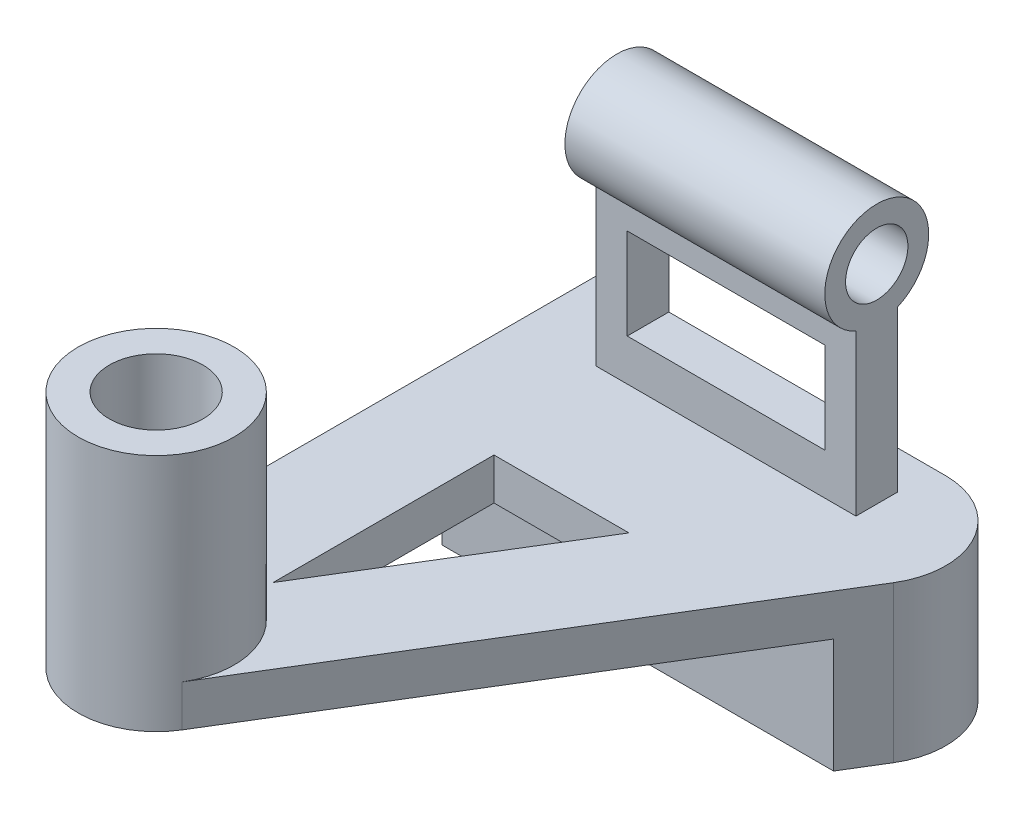
ISO-10303-21;
HEADER;
FILE_DESCRIPTION(('STEP AP214'),'2;1');
FILE_NAME('part.step','',(''),(''),'','','');
FILE_SCHEMA(('AUTOMOTIVE_DESIGN { 1 0 10303 214 1 1 1 1 }'));
ENDSEC;
DATA;
#1=APPLICATION_CONTEXT('core data for automotive mechanical design processes');
#2=APPLICATION_PROTOCOL_DEFINITION('international standard','automotive_design',2000,#1);
#3=PRODUCT_CONTEXT('',#1,'mechanical');
#4=PRODUCT('Part','Part','',(#3));
#5=PRODUCT_RELATED_PRODUCT_CATEGORY('part','',(#4));
#6=PRODUCT_DEFINITION_FORMATION('','',#4);
#7=PRODUCT_DEFINITION_CONTEXT('part definition',#1,'design');
#8=PRODUCT_DEFINITION('design','',#6,#7);
#9=PRODUCT_DEFINITION_SHAPE('','',#8);
#10=(LENGTH_UNIT() NAMED_UNIT(*) SI_UNIT(.MILLI.,.METRE.));
#11=(NAMED_UNIT(*) PLANE_ANGLE_UNIT() SI_UNIT($,.RADIAN.));
#12=(NAMED_UNIT(*) SI_UNIT($,.STERADIAN.) SOLID_ANGLE_UNIT());
#13=UNCERTAINTY_MEASURE_WITH_UNIT(LENGTH_MEASURE(1.E-05),#10,'distance_accuracy_value','');
#14=(GEOMETRIC_REPRESENTATION_CONTEXT(3) GLOBAL_UNCERTAINTY_ASSIGNED_CONTEXT((#13)) GLOBAL_UNIT_ASSIGNED_CONTEXT((#10,
#11,#12)) REPRESENTATION_CONTEXT('',''));
#15=CARTESIAN_POINT('',(0.,0.,0.));
#16=DIRECTION('',(0.,0.,1.));
#17=DIRECTION('',(1.,0.,0.));
#18=AXIS2_PLACEMENT_3D('',#15,#16,#17);
#19=CARTESIAN_POINT('',(66.9179016833369,8.,-30.3913043478261));
#20=DIRECTION('',(0.,-1.,0.));
#21=DIRECTION('',(0.,0.,-1.));
#22=AXIS2_PLACEMENT_3D('',#19,#20,#21);
#23=PLANE('',#22);
#24=DIRECTION('',(0.,0.,-1.));
#25=VECTOR('',#24,1.);
#26=CARTESIAN_POINT('',(65.,8.,-38.0259740090618));
#27=LINE('',#26,#25);
#28=CARTESIAN_POINT('',(65.,8.,-30.0259740090618));
#29=VERTEX_POINT('',#28);
#30=CARTESIAN_POINT('',(65.,8.,-38.0259740090618));
#31=VERTEX_POINT('',#30);
#32=EDGE_CURVE('E273',#29,#31,#27,.T.);
#33=ORIENTED_EDGE('',*,*,#32,.F.);
#34=DIRECTION('',(1.,0.,0.));
#35=VECTOR('',#34,1.);
#36=CARTESIAN_POINT('',(15.,8.,-30.0259740090618));
#37=LINE('',#36,#35);
#38=CARTESIAN_POINT('',(15.,8.,-30.0259740090618));
#39=VERTEX_POINT('',#38);
#40=EDGE_CURVE('E283',#39,#29,#37,.T.);
#41=ORIENTED_EDGE('',*,*,#40,.F.);
#42=DIRECTION('',(0.,0.,1.));
#43=VECTOR('',#42,1.);
#44=CARTESIAN_POINT('',(15.,8.,-38.0259740090618));
#45=LINE('',#44,#43);
#46=CARTESIAN_POINT('',(15.,8.,-38.0259740090618));
#47=VERTEX_POINT('',#46);
#48=EDGE_CURVE('E280',#47,#39,#45,.T.);
#49=ORIENTED_EDGE('',*,*,#48,.F.);
#50=DIRECTION('',(-1.,0.,0.));
#51=VECTOR('',#50,1.);
#52=CARTESIAN_POINT('',(15.,8.,-38.0259740090618));
#53=LINE('',#52,#51);
#54=EDGE_CURVE('E277',#31,#47,#53,.T.);
#55=ORIENTED_EDGE('',*,*,#54,.F.);
#56=EDGE_LOOP('',(#33,#41,#49,#55));
#57=FACE_BOUND('',#56,.T.);
#58=CARTESIAN_POINT('',(15.,8.,54.6086956521739));
#59=DIRECTION('',(0.,1.,0.));
#60=DIRECTION('',(0.,0.,1.));
#61=AXIS2_PLACEMENT_3D('',#58,#59,#60);
#62=CIRCLE('',#61,15.);
#63=CARTESIAN_POINT('',(27.8010057663305,8.,62.4275351677525));
#64=VERTEX_POINT('',#63);
#65=CARTESIAN_POINT('',(0.,8.,54.6086956521739));
#66=VERTEX_POINT('',#65);
#67=EDGE_CURVE('E220',#64,#66,#62,.T.);
#68=ORIENTED_EDGE('',*,*,#67,.F.);
#69=DIRECTION('',(0.521255967705237,0.,-0.853400384422035));
#70=VECTOR('',#69,1.);
#71=CARTESIAN_POINT('',(79.7189074496675,8.,-22.5724648322475));
#72=LINE('',#71,#70);
#73=CARTESIAN_POINT('',(79.7189074496675,8.,-22.5724648322475));
#74=VERTEX_POINT('',#73);
#75=EDGE_CURVE('E300',#64,#74,#72,.T.);
#76=ORIENTED_EDGE('',*,*,#75,.T.);
#77=CARTESIAN_POINT('',(66.9179016833369,8.,-30.3913043478261));
#78=DIRECTION('',(0.,1.,0.));
#79=DIRECTION('',(0.,0.,-1.));
#80=AXIS2_PLACEMENT_3D('',#77,#78,#79);
#81=CIRCLE('',#80,15.);
#82=CARTESIAN_POINT('',(66.9179016833369,8.,-45.3913043478261));
#83=VERTEX_POINT('',#82);
#84=EDGE_CURVE('E302',#74,#83,#81,.T.);
#85=ORIENTED_EDGE('',*,*,#84,.T.);
#86=DIRECTION('',(-1.,0.,0.));
#87=VECTOR('',#86,1.);
#88=CARTESIAN_POINT('',(0.,8.,-45.3913043478261));
#89=LINE('',#88,#87);
#90=CARTESIAN_POINT('',(0.,8.,-45.3913043478261));
#91=VERTEX_POINT('',#90);
#92=EDGE_CURVE('E295',#83,#91,#89,.T.);
#93=ORIENTED_EDGE('',*,*,#92,.T.);
#94=DIRECTION('',(0.,0.,1.));
#95=VECTOR('',#94,1.);
#96=CARTESIAN_POINT('',(0.,8.,54.6086956521739));
#97=LINE('',#96,#95);
#98=EDGE_CURVE('E298',#91,#66,#97,.T.);
#99=ORIENTED_EDGE('',*,*,#98,.T.);
#100=EDGE_LOOP('',(#68,#76,#85,#93,#99));
#101=FACE_BOUND('',#100,.T.);
#102=DIRECTION('',(1.,0.,0.));
#103=VECTOR('',#102,1.);
#104=CARTESIAN_POINT('',(20.,8.,-5.39130434782609));
#105=LINE('',#104,#103);
#106=CARTESIAN_POINT('',(20.,8.,-5.39130434782608));
#107=VERTEX_POINT('',#106);
#108=CARTESIAN_POINT('',(45.9589508416685,8.,-5.3913043478261));
#109=VERTEX_POINT('',#108);
#110=EDGE_CURVE('E64',#107,#109,#105,.T.);
#111=ORIENTED_EDGE('',*,*,#110,.T.);
#112=DIRECTION('',(-0.521255967705237,0.,0.853400384422035));
#113=VECTOR('',#112,1.);
#114=CARTESIAN_POINT('',(45.9589508416685,8.,-5.3913043478261));
#115=LINE('',#114,#113);
#116=CARTESIAN_POINT('',(20.,8.,37.1086956521739));
#117=VERTEX_POINT('',#116);
#118=EDGE_CURVE('E201',#109,#117,#115,.T.);
#119=ORIENTED_EDGE('',*,*,#118,.T.);
#120=DIRECTION('',(0.,0.,-1.));
#121=VECTOR('',#120,1.);
#122=CARTESIAN_POINT('',(20.,8.,37.1086956521739));
#123=LINE('',#122,#121);
#124=EDGE_CURVE('E204',#117,#107,#123,.T.);
#125=ORIENTED_EDGE('',*,*,#124,.T.);
#126=EDGE_LOOP('',(#111,#119,#125));
#127=FACE_BOUND('',#126,.T.);
#128=ADVANCED_FACE('F41',(#57,#101,#127),#23,.F.);
#129=CARTESIAN_POINT('',(66.9179016833369,0.,-30.3913043478261));
#130=DIRECTION('',(0.,-1.,0.));
#131=DIRECTION('',(0.,0.,-1.));
#132=AXIS2_PLACEMENT_3D('',#129,#130,#131);
#133=PLANE('',#132);
#134=DIRECTION('',(-1.,0.,0.));
#135=VECTOR('',#134,1.);
#136=CARTESIAN_POINT('',(75.3326629319915,0.,-15.3913043478261));
#137=LINE('',#136,#135);
#138=CARTESIAN_POINT('',(75.3326629319915,0.,-15.3913043478261));
#139=VERTEX_POINT('',#138);
#140=CARTESIAN_POINT('',(0.,0.,-15.3913043478261));
#141=VERTEX_POINT('',#140);
#142=EDGE_CURVE('E56',#139,#141,#137,.T.);
#143=ORIENTED_EDGE('',*,*,#142,.F.);
#144=DIRECTION('',(0.521255967705237,0.,-0.853400384422035));
#145=VECTOR('',#144,1.);
#146=CARTESIAN_POINT('',(79.7189074496675,0.,-22.5724648322475));
#147=LINE('',#146,#145);
#148=CARTESIAN_POINT('',(27.8010057663305,0.,62.4275351677525));
#149=VERTEX_POINT('',#148);
#150=EDGE_CURVE('E190',#149,#139,#147,.T.);
#151=ORIENTED_EDGE('',*,*,#150,.F.);
#152=CARTESIAN_POINT('',(15.,0.,54.6086956521739));
#153=DIRECTION('',(0.,1.,0.));
#154=DIRECTION('',(0.,0.,1.));
#155=AXIS2_PLACEMENT_3D('',#152,#153,#154);
#156=CIRCLE('',#155,15.);
#157=CARTESIAN_POINT('',(0.,0.,54.6086956521739));
#158=VERTEX_POINT('',#157);
#159=EDGE_CURVE('E306',#158,#149,#156,.T.);
#160=ORIENTED_EDGE('',*,*,#159,.F.);
#161=DIRECTION('',(0.,0.,1.));
#162=VECTOR('',#161,1.);
#163=CARTESIAN_POINT('',(0.,0.,54.6086956521739));
#164=LINE('',#163,#162);
#165=EDGE_CURVE('E294',#141,#158,#164,.T.);
#166=ORIENTED_EDGE('',*,*,#165,.F.);
#167=EDGE_LOOP('',(#143,#151,#160,#166));
#168=FACE_BOUND('',#167,.T.);
#169=CARTESIAN_POINT('',(15.,0.,54.6086956521739));
#170=DIRECTION('',(0.,-1.,0.));
#171=DIRECTION('',(0.,0.,-1.));
#172=AXIS2_PLACEMENT_3D('',#169,#170,#171);
#173=CIRCLE('',#172,9.);
#174=CARTESIAN_POINT('',(15.,0.,45.6086956521739));
#175=VERTEX_POINT('',#174);
#176=EDGE_CURVE('E216',#175,#175,#173,.F.);
#177=ORIENTED_EDGE('',*,*,#176,.T.);
#178=EDGE_LOOP('',(#177));
#179=FACE_BOUND('',#178,.T.);
#180=DIRECTION('',(-0.521255967705237,0.,0.853400384422035));
#181=VECTOR('',#180,1.);
#182=CARTESIAN_POINT('',(45.9589508416685,0.,-5.3913043478261));
#183=LINE('',#182,#181);
#184=CARTESIAN_POINT('',(45.9589508416685,0.,-5.3913043478261));
#185=VERTEX_POINT('',#184);
#186=CARTESIAN_POINT('',(20.,0.,37.1086956521739));
#187=VERTEX_POINT('',#186);
#188=EDGE_CURVE('E191',#185,#187,#183,.T.);
#189=ORIENTED_EDGE('',*,*,#188,.F.);
#190=DIRECTION('',(1.,0.,0.));
#191=VECTOR('',#190,1.);
#192=CARTESIAN_POINT('',(20.,0.,-5.39130434782609));
#193=LINE('',#192,#191);
#194=CARTESIAN_POINT('',(20.,0.,-5.39130434782608));
#195=VERTEX_POINT('',#194);
#196=EDGE_CURVE('E193',#195,#185,#193,.T.);
#197=ORIENTED_EDGE('',*,*,#196,.F.);
#198=DIRECTION('',(0.,0.,-1.));
#199=VECTOR('',#198,1.);
#200=CARTESIAN_POINT('',(20.,0.,37.1086956521739));
#201=LINE('',#200,#199);
#202=EDGE_CURVE('E213',#187,#195,#201,.T.);
#203=ORIENTED_EDGE('',*,*,#202,.F.);
#204=EDGE_LOOP('',(#189,#197,#203));
#205=FACE_BOUND('',#204,.T.);
#206=ADVANCED_FACE('F322',(#168,#179,#205),#133,.T.);
#207=CARTESIAN_POINT('',(65.,46.,-38.0259740090618));
#208=DIRECTION('',(-1.,0.,0.));
#209=DIRECTION('',(0.,0.,1.));
#210=AXIS2_PLACEMENT_3D('',#207,#208,#209);
#211=PLANE('',#210);
#212=CARTESIAN_POINT('',(65.,48.,-34.0259740090618));
#213=DIRECTION('',(1.,0.,0.));
#214=DIRECTION('',(0.,0.,-1.));
#215=AXIS2_PLACEMENT_3D('',#212,#213,#214);
#216=CIRCLE('',#215,6.);
#217=CARTESIAN_POINT('',(65.,48.,-40.0259740090618));
#218=VERTEX_POINT('',#217);
#219=EDGE_CURVE('E259',#218,#218,#216,.T.);
#220=ORIENTED_EDGE('',*,*,#219,.F.);
#221=EDGE_LOOP('',(#220));
#222=FACE_BOUND('',#221,.T.);
#223=CARTESIAN_POINT('',(65.,48.,-34.0259740090618));
#224=DIRECTION('',(1.,0.,0.));
#225=DIRECTION('',(0.,0.,-1.));
#226=AXIS2_PLACEMENT_3D('',#223,#224,#225);
#227=CIRCLE('',#226,10.);
#228=CARTESIAN_POINT('',(65.,38.8348486100883,-38.0259740090618));
#229=VERTEX_POINT('',#228);
#230=CARTESIAN_POINT('',(65.,38.8348486100883,-30.0259740090618));
#231=VERTEX_POINT('',#230);
#232=EDGE_CURVE('E263',#229,#231,#227,.T.);
#233=ORIENTED_EDGE('',*,*,#232,.T.);
#234=DIRECTION('',(0.,-1.,0.));
#235=VECTOR('',#234,1.);
#236=CARTESIAN_POINT('',(65.,46.,-30.0259740090618));
#237=LINE('',#236,#235);
#238=EDGE_CURVE('E286',#231,#29,#237,.T.);
#239=ORIENTED_EDGE('',*,*,#238,.T.);
#240=ORIENTED_EDGE('',*,*,#32,.T.);
#241=DIRECTION('',(0.,-1.,0.));
#242=VECTOR('',#241,1.);
#243=CARTESIAN_POINT('',(65.,46.,-38.0259740090618));
#244=LINE('',#243,#242);
#245=EDGE_CURVE('E292',#229,#31,#244,.T.);
#246=ORIENTED_EDGE('',*,*,#245,.F.);
#247=EDGE_LOOP('',(#233,#239,#240,#246));
#248=FACE_BOUND('',#247,.T.);
#249=ADVANCED_FACE('F345',(#222,#248),#211,.F.);
#250=CARTESIAN_POINT('',(15.,46.,-38.0259740090618));
#251=DIRECTION('',(1.,0.,0.));
#252=DIRECTION('',(0.,0.,-1.));
#253=AXIS2_PLACEMENT_3D('',#250,#251,#252);
#254=PLANE('',#253);
#255=CARTESIAN_POINT('',(15.,48.,-34.0259740090617));
#256=DIRECTION('',(1.,0.,0.));
#257=DIRECTION('',(0.,0.,-1.));
#258=AXIS2_PLACEMENT_3D('',#255,#256,#257);
#259=CIRCLE('',#258,6.);
#260=CARTESIAN_POINT('',(15.,48.,-40.0259740090617));
#261=VERTEX_POINT('',#260);
#262=EDGE_CURVE('E260',#261,#261,#259,.T.);
#263=ORIENTED_EDGE('',*,*,#262,.T.);
#264=EDGE_LOOP('',(#263));
#265=FACE_BOUND('',#264,.T.);
#266=DIRECTION('',(0.,-1.,0.));
#267=VECTOR('',#266,1.);
#268=CARTESIAN_POINT('',(15.,46.,-30.0259740090618));
#269=LINE('',#268,#267);
#270=CARTESIAN_POINT('',(15.,38.8348486100883,-30.0259740090618));
#271=VERTEX_POINT('',#270);
#272=EDGE_CURVE('E288',#271,#39,#269,.T.);
#273=ORIENTED_EDGE('',*,*,#272,.F.);
#274=CARTESIAN_POINT('',(15.,48.,-34.0259740090617));
#275=DIRECTION('',(1.,0.,0.));
#276=DIRECTION('',(0.,0.,-1.));
#277=AXIS2_PLACEMENT_3D('',#274,#275,#276);
#278=CIRCLE('',#277,10.);
#279=CARTESIAN_POINT('',(15.,38.8348486100883,-38.0259740090618));
#280=VERTEX_POINT('',#279);
#281=EDGE_CURVE('E266',#280,#271,#278,.T.);
#282=ORIENTED_EDGE('',*,*,#281,.F.);
#283=DIRECTION('',(0.,-1.,0.));
#284=VECTOR('',#283,1.);
#285=CARTESIAN_POINT('',(15.,46.,-38.0259740090618));
#286=LINE('',#285,#284);
#287=EDGE_CURVE('E290',#280,#47,#286,.T.);
#288=ORIENTED_EDGE('',*,*,#287,.T.);
#289=ORIENTED_EDGE('',*,*,#48,.T.);
#290=EDGE_LOOP('',(#273,#282,#288,#289));
#291=FACE_BOUND('',#290,.T.);
#292=ADVANCED_FACE('F340',(#265,#291),#254,.F.);
#293=CARTESIAN_POINT('',(0.,8.,-45.3913043478261));
#294=DIRECTION('',(0.,0.,1.));
#295=DIRECTION('',(1.,0.,0.));
#296=AXIS2_PLACEMENT_3D('',#293,#294,#295);
#297=PLANE('',#296);
#298=DIRECTION('',(0.,-1.,0.));
#299=VECTOR('',#298,1.);
#300=CARTESIAN_POINT('',(66.9179016833369,8.,-45.3913043478261));
#301=LINE('',#300,#299);
#302=CARTESIAN_POINT('',(66.9179016833369,-22.,-45.3913043478261));
#303=VERTEX_POINT('',#302);
#304=EDGE_CURVE('E304',#83,#303,#301,.T.);
#305=ORIENTED_EDGE('',*,*,#304,.T.);
#306=DIRECTION('',(1.,0.,0.));
#307=VECTOR('',#306,1.);
#308=CARTESIAN_POINT('',(0.,-22.,-45.3913043478261));
#309=LINE('',#308,#307);
#310=CARTESIAN_POINT('',(0.,-22.,-45.3913043478261));
#311=VERTEX_POINT('',#310);
#312=EDGE_CURVE('E327',#311,#303,#309,.T.);
#313=ORIENTED_EDGE('',*,*,#312,.F.);
#314=DIRECTION('',(0.,-1.,0.));
#315=VECTOR('',#314,1.);
#316=CARTESIAN_POINT('',(0.,8.,-45.3913043478261));
#317=LINE('',#316,#315);
#318=EDGE_CURVE('E11',#91,#311,#317,.T.);
#319=ORIENTED_EDGE('',*,*,#318,.F.);
#320=ORIENTED_EDGE('',*,*,#92,.F.);
#321=EDGE_LOOP('',(#305,#313,#319,#320));
#322=FACE_BOUND('',#321,.T.);
#323=ADVANCED_FACE('F43',(#322),#297,.F.);
#324=CARTESIAN_POINT('',(0.,8.,54.6086956521739));
#325=DIRECTION('',(1.,0.,0.));
#326=DIRECTION('',(0.,0.,-1.));
#327=AXIS2_PLACEMENT_3D('',#324,#325,#326);
#328=PLANE('',#327);
#329=ORIENTED_EDGE('',*,*,#318,.T.);
#330=DIRECTION('',(0.,0.,-1.));
#331=VECTOR('',#330,1.);
#332=CARTESIAN_POINT('',(0.,-22.,-15.3913043478261));
#333=LINE('',#332,#331);
#334=CARTESIAN_POINT('',(0.,-22.,-15.3913043478261));
#335=VERTEX_POINT('',#334);
#336=EDGE_CURVE('E176',#335,#311,#333,.T.);
#337=ORIENTED_EDGE('',*,*,#336,.F.);
#338=DIRECTION('',(0.,1.,0.));
#339=VECTOR('',#338,1.);
#340=CARTESIAN_POINT('',(0.,-22.,-15.3913043478261));
#341=LINE('',#340,#339);
#342=EDGE_CURVE('E172',#335,#141,#341,.T.);
#343=ORIENTED_EDGE('',*,*,#342,.T.);
#344=ORIENTED_EDGE('',*,*,#165,.T.);
#345=DIRECTION('',(0.,-1.,0.));
#346=VECTOR('',#345,1.);
#347=CARTESIAN_POINT('',(0.,8.,54.6086956521739));
#348=LINE('',#347,#346);
#349=EDGE_CURVE('E49',#66,#158,#348,.T.);
#350=ORIENTED_EDGE('',*,*,#349,.F.);
#351=ORIENTED_EDGE('',*,*,#98,.F.);
#352=EDGE_LOOP('',(#329,#337,#343,#344,#350,#351));
#353=FACE_BOUND('',#352,.T.);
#354=ADVANCED_FACE('F324',(#353),#328,.F.);
#355=CARTESIAN_POINT('',(15.,8.,54.6086956521739));
#356=DIRECTION('',(0.,-1.,0.));
#357=DIRECTION('',(0.,0.,-1.));
#358=AXIS2_PLACEMENT_3D('',#355,#356,#357);
#359=CYLINDRICAL_SURFACE('',#358,15.);
#360=ORIENTED_EDGE('',*,*,#159,.T.);
#361=DIRECTION('',(0.,-1.,0.));
#362=VECTOR('',#361,1.);
#363=CARTESIAN_POINT('',(27.8010057663305,8.,62.4275351677525));
#364=LINE('',#363,#362);
#365=EDGE_CURVE('E312',#64,#149,#364,.T.);
#366=ORIENTED_EDGE('',*,*,#365,.F.);
#367=ORIENTED_EDGE('',*,*,#67,.T.);
#368=ORIENTED_EDGE('',*,*,#349,.T.);
#369=EDGE_LOOP('',(#360,#366,#367,#368));
#370=FACE_BOUND('',#369,.T.);
#371=CARTESIAN_POINT('',(15.,46.,54.6086956521739));
#372=DIRECTION('',(0.,1.,0.));
#373=DIRECTION('',(0.,0.,1.));
#374=AXIS2_PLACEMENT_3D('',#371,#372,#373);
#375=CIRCLE('',#374,15.);
#376=CARTESIAN_POINT('',(15.,46.,69.6086956521739));
#377=VERTEX_POINT('',#376);
#378=EDGE_CURVE('E223',#377,#377,#375,.T.);
#379=ORIENTED_EDGE('',*,*,#378,.F.);
#380=EDGE_LOOP('',(#379));
#381=FACE_BOUND('',#380,.T.);
#382=ADVANCED_FACE('F317',(#370,#381),#359,.T.);
#383=CARTESIAN_POINT('',(79.7189074496675,8.,-22.5724648322475));
#384=DIRECTION('',(-0.853400384422035,0.,-0.521255967705237));
#385=DIRECTION('',(-0.521255967705237,0.,0.853400384422035));
#386=AXIS2_PLACEMENT_3D('',#383,#384,#385);
#387=PLANE('',#386);
#388=ORIENTED_EDGE('',*,*,#150,.T.);
#389=DIRECTION('',(0.,1.,0.));
#390=VECTOR('',#389,1.);
#391=CARTESIAN_POINT('',(75.3326629319915,-22.,-15.3913043478261));
#392=LINE('',#391,#390);
#393=CARTESIAN_POINT('',(75.3326629319915,-22.,-15.3913043478261));
#394=VERTEX_POINT('',#393);
#395=EDGE_CURVE('E170',#394,#139,#392,.T.);
#396=ORIENTED_EDGE('',*,*,#395,.F.);
#397=DIRECTION('',(-0.521255967705237,0.,0.853400384422035));
#398=VECTOR('',#397,1.);
#399=CARTESIAN_POINT('',(79.7189074496675,-22.,-22.5724648322475));
#400=LINE('',#399,#398);
#401=CARTESIAN_POINT('',(79.7189074496675,-22.,-22.5724648322475));
#402=VERTEX_POINT('',#401);
#403=EDGE_CURVE('E177',#402,#394,#400,.T.);
#404=ORIENTED_EDGE('',*,*,#403,.F.);
#405=DIRECTION('',(0.,-1.,0.));
#406=VECTOR('',#405,1.);
#407=CARTESIAN_POINT('',(79.7189074496675,8.,-22.5724648322475));
#408=LINE('',#407,#406);
#409=EDGE_CURVE('E310',#74,#402,#408,.T.);
#410=ORIENTED_EDGE('',*,*,#409,.F.);
#411=ORIENTED_EDGE('',*,*,#75,.F.);
#412=ORIENTED_EDGE('',*,*,#365,.T.);
#413=EDGE_LOOP('',(#388,#396,#404,#410,#411,#412));
#414=FACE_BOUND('',#413,.T.);
#415=ADVANCED_FACE('F188',(#414),#387,.F.);
#416=CARTESIAN_POINT('',(66.9179016833369,8.,-30.3913043478261));
#417=DIRECTION('',(0.,-1.,0.));
#418=DIRECTION('',(0.,0.,-1.));
#419=AXIS2_PLACEMENT_3D('',#416,#417,#418);
#420=CYLINDRICAL_SURFACE('',#419,15.);
#421=ORIENTED_EDGE('',*,*,#409,.T.);
#422=CARTESIAN_POINT('',(66.9179016833369,-22.,-30.3913043478261));
#423=DIRECTION('',(0.,-1.,0.));
#424=DIRECTION('',(0.,0.,-1.));
#425=AXIS2_PLACEMENT_3D('',#422,#423,#424);
#426=CIRCLE('',#425,15.);
#427=EDGE_CURVE('E184',#303,#402,#426,.T.);
#428=ORIENTED_EDGE('',*,*,#427,.F.);
#429=ORIENTED_EDGE('',*,*,#304,.F.);
#430=ORIENTED_EDGE('',*,*,#84,.F.);
#431=EDGE_LOOP('',(#421,#428,#429,#430));
#432=FACE_BOUND('',#431,.T.);
#433=ADVANCED_FACE('F334',(#432),#420,.T.);
#434=CARTESIAN_POINT('',(15.,46.,-38.0259740090618));
#435=DIRECTION('',(0.,0.,1.));
#436=DIRECTION('',(1.,0.,0.));
#437=AXIS2_PLACEMENT_3D('',#434,#435,#436);
#438=PLANE('',#437);
#439=DIRECTION('',(-1.,0.,0.));
#440=VECTOR('',#439,1.);
#441=CARTESIAN_POINT('',(21.,16.,-38.0259740090618));
#442=LINE('',#441,#440);
#443=CARTESIAN_POINT('',(59.0000000000001,16.,-38.0259740090618));
#444=VERTEX_POINT('',#443);
#445=CARTESIAN_POINT('',(21.,16.,-38.0259740090618));
#446=VERTEX_POINT('',#445);
#447=EDGE_CURVE('E230',#444,#446,#442,.T.);
#448=ORIENTED_EDGE('',*,*,#447,.F.);
#449=DIRECTION('',(0.,-1.,0.));
#450=VECTOR('',#449,1.);
#451=CARTESIAN_POINT('',(59.0000000000001,33.5077024158081,-38.0259740090618));
#452=LINE('',#451,#450);
#453=CARTESIAN_POINT('',(59.0000000000001,33.5077024158081,-38.0259740090618));
#454=VERTEX_POINT('',#453);
#455=EDGE_CURVE('E233',#454,#444,#452,.T.);
#456=ORIENTED_EDGE('',*,*,#455,.F.);
#457=DIRECTION('',(1.,0.,0.));
#458=VECTOR('',#457,1.);
#459=CARTESIAN_POINT('',(21.,33.5077024158081,-38.0259740090618));
#460=LINE('',#459,#458);
#461=CARTESIAN_POINT('',(21.,33.5077024158081,-38.0259740090618));
#462=VERTEX_POINT('',#461);
#463=EDGE_CURVE('E250',#462,#454,#460,.T.);
#464=ORIENTED_EDGE('',*,*,#463,.F.);
#465=DIRECTION('',(0.,1.,0.));
#466=VECTOR('',#465,1.);
#467=CARTESIAN_POINT('',(21.,33.5077024158081,-38.0259740090618));
#468=LINE('',#467,#466);
#469=EDGE_CURVE('E226',#446,#462,#468,.T.);
#470=ORIENTED_EDGE('',*,*,#469,.F.);
#471=EDGE_LOOP('',(#448,#456,#464,#470));
#472=FACE_BOUND('',#471,.T.);
#473=ORIENTED_EDGE('',*,*,#287,.F.);
#474=DIRECTION('',(1.,0.,0.));
#475=VECTOR('',#474,1.);
#476=CARTESIAN_POINT('',(15.,38.8348486100883,-38.0259740090617));
#477=LINE('',#476,#475);
#478=EDGE_CURVE('E268',#280,#229,#477,.T.);
#479=ORIENTED_EDGE('',*,*,#478,.T.);
#480=ORIENTED_EDGE('',*,*,#245,.T.);
#481=ORIENTED_EDGE('',*,*,#54,.T.);
#482=EDGE_LOOP('',(#473,#479,#480,#481));
#483=FACE_BOUND('',#482,.T.);
#484=ADVANCED_FACE('F361',(#472,#483),#438,.F.);
#485=CARTESIAN_POINT('',(15.,46.,-30.0259740090618));
#486=DIRECTION('',(0.,0.,-1.));
#487=DIRECTION('',(-1.,0.,0.));
#488=AXIS2_PLACEMENT_3D('',#485,#486,#487);
#489=PLANE('',#488);
#490=DIRECTION('',(-1.,0.,0.));
#491=VECTOR('',#490,1.);
#492=CARTESIAN_POINT('',(21.,33.5077024158081,-30.0259740090618));
#493=LINE('',#492,#491);
#494=CARTESIAN_POINT('',(59.0000000000001,33.5077024158081,-30.0259740090618));
#495=VERTEX_POINT('',#494);
#496=CARTESIAN_POINT('',(21.,33.5077024158081,-30.0259740090618));
#497=VERTEX_POINT('',#496);
#498=EDGE_CURVE('E238',#495,#497,#493,.T.);
#499=ORIENTED_EDGE('',*,*,#498,.F.);
#500=DIRECTION('',(0.,1.,0.));
#501=VECTOR('',#500,1.);
#502=CARTESIAN_POINT('',(59.0000000000001,33.5077024158081,-30.0259740090618));
#503=LINE('',#502,#501);
#504=CARTESIAN_POINT('',(59.0000000000001,16.,-30.0259740090618));
#505=VERTEX_POINT('',#504);
#506=EDGE_CURVE('E236',#505,#495,#503,.T.);
#507=ORIENTED_EDGE('',*,*,#506,.F.);
#508=DIRECTION('',(1.,0.,0.));
#509=VECTOR('',#508,1.);
#510=CARTESIAN_POINT('',(21.,16.,-30.0259740090618));
#511=LINE('',#510,#509);
#512=CARTESIAN_POINT('',(21.,16.,-30.0259740090618));
#513=VERTEX_POINT('',#512);
#514=EDGE_CURVE('E244',#513,#505,#511,.T.);
#515=ORIENTED_EDGE('',*,*,#514,.F.);
#516=DIRECTION('',(0.,-1.,0.));
#517=VECTOR('',#516,1.);
#518=CARTESIAN_POINT('',(21.,33.5077024158081,-30.0259740090618));
#519=LINE('',#518,#517);
#520=EDGE_CURVE('E241',#497,#513,#519,.T.);
#521=ORIENTED_EDGE('',*,*,#520,.F.);
#522=EDGE_LOOP('',(#499,#507,#515,#521));
#523=FACE_BOUND('',#522,.T.);
#524=ORIENTED_EDGE('',*,*,#238,.F.);
#525=DIRECTION('',(1.,0.,0.));
#526=VECTOR('',#525,1.);
#527=CARTESIAN_POINT('',(15.,38.8348486100883,-30.0259740090617));
#528=LINE('',#527,#526);
#529=EDGE_CURVE('E270',#271,#231,#528,.T.);
#530=ORIENTED_EDGE('',*,*,#529,.F.);
#531=ORIENTED_EDGE('',*,*,#272,.T.);
#532=ORIENTED_EDGE('',*,*,#40,.T.);
#533=EDGE_LOOP('',(#524,#530,#531,#532));
#534=FACE_BOUND('',#533,.T.);
#535=ADVANCED_FACE('F386',(#523,#534),#489,.F.);
#536=CARTESIAN_POINT('',(15.,48.,-34.0259740090617));
#537=DIRECTION('',(1.,0.,0.));
#538=DIRECTION('',(0.,0.,-1.));
#539=AXIS2_PLACEMENT_3D('',#536,#537,#538);
#540=CYLINDRICAL_SURFACE('',#539,10.);
#541=ORIENTED_EDGE('',*,*,#281,.T.);
#542=ORIENTED_EDGE('',*,*,#529,.T.);
#543=ORIENTED_EDGE('',*,*,#232,.F.);
#544=ORIENTED_EDGE('',*,*,#478,.F.);
#545=EDGE_LOOP('',(#541,#542,#543,#544));
#546=FACE_BOUND('',#545,.T.);
#547=ADVANCED_FACE('F394',(#546),#540,.T.);
#548=CARTESIAN_POINT('',(15.,48.,-34.0259740090617));
#549=DIRECTION('',(1.,0.,0.));
#550=DIRECTION('',(0.,0.,-1.));
#551=AXIS2_PLACEMENT_3D('',#548,#549,#550);
#552=CYLINDRICAL_SURFACE('',#551,6.);
#553=ORIENTED_EDGE('',*,*,#262,.F.);
#554=EDGE_LOOP('',(#553));
#555=FACE_BOUND('',#554,.T.);
#556=ORIENTED_EDGE('',*,*,#219,.T.);
#557=EDGE_LOOP('',(#556));
#558=FACE_BOUND('',#557,.T.);
#559=ADVANCED_FACE('F403',(#555,#558),#552,.F.);
#560=CARTESIAN_POINT('',(59.0000000000001,33.5077024158081,-45.3923043478261));
#561=DIRECTION('',(1.,0.,0.));
#562=DIRECTION('',(0.,0.,-1.));
#563=AXIS2_PLACEMENT_3D('',#560,#561,#562);
#564=PLANE('',#563);
#565=ORIENTED_EDGE('',*,*,#455,.T.);
#566=DIRECTION('',(0.,0.,1.));
#567=VECTOR('',#566,1.);
#568=CARTESIAN_POINT('',(59.0000000000001,16.,-45.3923043478261));
#569=LINE('',#568,#567);
#570=EDGE_CURVE('E248',#444,#505,#569,.T.);
#571=ORIENTED_EDGE('',*,*,#570,.T.);
#572=ORIENTED_EDGE('',*,*,#506,.T.);
#573=DIRECTION('',(0.,0.,1.));
#574=VECTOR('',#573,1.);
#575=CARTESIAN_POINT('',(59.0000000000001,33.5077024158081,-45.3923043478261));
#576=LINE('',#575,#574);
#577=EDGE_CURVE('E247',#454,#495,#576,.T.);
#578=ORIENTED_EDGE('',*,*,#577,.F.);
#579=EDGE_LOOP('',(#565,#571,#572,#578));
#580=FACE_BOUND('',#579,.T.);
#581=ADVANCED_FACE('F411',(#580),#564,.F.);
#582=CARTESIAN_POINT('',(21.,16.,-45.3923043478261));
#583=DIRECTION('',(0.,-1.,0.));
#584=DIRECTION('',(0.,0.,-1.));
#585=AXIS2_PLACEMENT_3D('',#582,#583,#584);
#586=PLANE('',#585);
#587=ORIENTED_EDGE('',*,*,#447,.T.);
#588=DIRECTION('',(0.,0.,1.));
#589=VECTOR('',#588,1.);
#590=CARTESIAN_POINT('',(21.,16.,-45.3923043478261));
#591=LINE('',#590,#589);
#592=EDGE_CURVE('E251',#446,#513,#591,.T.);
#593=ORIENTED_EDGE('',*,*,#592,.T.);
#594=ORIENTED_EDGE('',*,*,#514,.T.);
#595=ORIENTED_EDGE('',*,*,#570,.F.);
#596=EDGE_LOOP('',(#587,#593,#594,#595));
#597=FACE_BOUND('',#596,.T.);
#598=ADVANCED_FACE('F419',(#597),#586,.F.);
#599=CARTESIAN_POINT('',(21.,33.5077024158081,-45.3923043478261));
#600=DIRECTION('',(-1.,0.,0.));
#601=DIRECTION('',(0.,-1.,0.));
#602=AXIS2_PLACEMENT_3D('',#599,#600,#601);
#603=PLANE('',#602);
#604=ORIENTED_EDGE('',*,*,#469,.T.);
#605=DIRECTION('',(0.,0.,1.));
#606=VECTOR('',#605,1.);
#607=CARTESIAN_POINT('',(21.,33.5077024158081,-45.3923043478261));
#608=LINE('',#607,#606);
#609=EDGE_CURVE('E253',#462,#497,#608,.T.);
#610=ORIENTED_EDGE('',*,*,#609,.T.);
#611=ORIENTED_EDGE('',*,*,#520,.T.);
#612=ORIENTED_EDGE('',*,*,#592,.F.);
#613=EDGE_LOOP('',(#604,#610,#611,#612));
#614=FACE_BOUND('',#613,.T.);
#615=ADVANCED_FACE('F427',(#614),#603,.F.);
#616=CARTESIAN_POINT('',(21.,33.5077024158081,-45.3923043478261));
#617=DIRECTION('',(0.,1.,0.));
#618=DIRECTION('',(0.,0.,1.));
#619=AXIS2_PLACEMENT_3D('',#616,#617,#618);
#620=PLANE('',#619);
#621=ORIENTED_EDGE('',*,*,#463,.T.);
#622=ORIENTED_EDGE('',*,*,#577,.T.);
#623=ORIENTED_EDGE('',*,*,#498,.T.);
#624=ORIENTED_EDGE('',*,*,#609,.F.);
#625=EDGE_LOOP('',(#621,#622,#623,#624));
#626=FACE_BOUND('',#625,.T.);
#627=ADVANCED_FACE('F435',(#626),#620,.F.);
#628=CARTESIAN_POINT('',(0.,46.,0.));
#629=DIRECTION('',(0.,1.,0.));
#630=DIRECTION('',(0.,0.,1.));
#631=AXIS2_PLACEMENT_3D('',#628,#629,#630);
#632=PLANE('',#631);
#633=CARTESIAN_POINT('',(15.,46.,54.6086956521739));
#634=DIRECTION('',(0.,1.,0.));
#635=DIRECTION('',(0.,0.,1.));
#636=AXIS2_PLACEMENT_3D('',#633,#634,#635);
#637=CIRCLE('',#636,9.);
#638=CARTESIAN_POINT('',(15.,46.,63.6086956521739));
#639=VERTEX_POINT('',#638);
#640=EDGE_CURVE('E217',#639,#639,#637,.T.);
#641=ORIENTED_EDGE('',*,*,#640,.F.);
#642=EDGE_LOOP('',(#641));
#643=FACE_BOUND('',#642,.T.);
#644=ORIENTED_EDGE('',*,*,#378,.T.);
#645=EDGE_LOOP('',(#644));
#646=FACE_BOUND('',#645,.T.);
#647=ADVANCED_FACE('F442',(#643,#646),#632,.T.);
#648=CARTESIAN_POINT('',(15.,-0.001000000000001,54.6086956521739));
#649=DIRECTION('',(0.,1.,0.));
#650=DIRECTION('',(0.,0.,1.));
#651=AXIS2_PLACEMENT_3D('',#648,#649,#650);
#652=CYLINDRICAL_SURFACE('',#651,9.);
#653=ORIENTED_EDGE('',*,*,#176,.F.);
#654=EDGE_LOOP('',(#653));
#655=FACE_BOUND('',#654,.T.);
#656=ORIENTED_EDGE('',*,*,#640,.T.);
#657=EDGE_LOOP('',(#656));
#658=FACE_BOUND('',#657,.T.);
#659=ADVANCED_FACE('F449',(#655,#658),#652,.F.);
#660=CARTESIAN_POINT('',(20.,-0.000999999999999265,-5.39130434782609));
#661=DIRECTION('',(0.,0.,1.));
#662=DIRECTION('',(1.,0.,0.));
#663=AXIS2_PLACEMENT_3D('',#660,#661,#662);
#664=PLANE('',#663);
#665=ORIENTED_EDGE('',*,*,#196,.T.);
#666=DIRECTION('',(0.,1.,0.));
#667=VECTOR('',#666,1.);
#668=CARTESIAN_POINT('',(45.9589508416685,-0.000999999999999265,-5.3913043478261));
#669=LINE('',#668,#667);
#670=EDGE_CURVE('E211',#185,#109,#669,.T.);
#671=ORIENTED_EDGE('',*,*,#670,.T.);
#672=ORIENTED_EDGE('',*,*,#110,.F.);
#673=DIRECTION('',(0.,1.,0.));
#674=VECTOR('',#673,1.);
#675=CARTESIAN_POINT('',(20.,-0.000999999999999265,-5.39130434782609));
#676=LINE('',#675,#674);
#677=EDGE_CURVE('E207',#195,#107,#676,.T.);
#678=ORIENTED_EDGE('',*,*,#677,.F.);
#679=EDGE_LOOP('',(#665,#671,#672,#678));
#680=FACE_BOUND('',#679,.T.);
#681=ADVANCED_FACE('F457',(#680),#664,.T.);
#682=CARTESIAN_POINT('',(45.9589508416685,-0.000999999999999265,-5.3913043478261));
#683=DIRECTION('',(-0.853400384422035,0.,-0.521255967705237));
#684=DIRECTION('',(-0.521255967705237,0.,0.853400384422035));
#685=AXIS2_PLACEMENT_3D('',#682,#683,#684);
#686=PLANE('',#685);
#687=ORIENTED_EDGE('',*,*,#188,.T.);
#688=DIRECTION('',(0.,1.,0.));
#689=VECTOR('',#688,1.);
#690=CARTESIAN_POINT('',(20.,-0.000999999999999265,37.1086956521739));
#691=LINE('',#690,#689);
#692=EDGE_CURVE('E209',#187,#117,#691,.T.);
#693=ORIENTED_EDGE('',*,*,#692,.T.);
#694=ORIENTED_EDGE('',*,*,#118,.F.);
#695=ORIENTED_EDGE('',*,*,#670,.F.);
#696=EDGE_LOOP('',(#687,#693,#694,#695));
#697=FACE_BOUND('',#696,.T.);
#698=ADVANCED_FACE('F465',(#697),#686,.T.);
#699=CARTESIAN_POINT('',(20.,-0.000999999999999265,37.1086956521739));
#700=DIRECTION('',(1.,0.,0.));
#701=DIRECTION('',(0.,0.,-1.));
#702=AXIS2_PLACEMENT_3D('',#699,#700,#701);
#703=PLANE('',#702);
#704=ORIENTED_EDGE('',*,*,#202,.T.);
#705=ORIENTED_EDGE('',*,*,#677,.T.);
#706=ORIENTED_EDGE('',*,*,#124,.F.);
#707=ORIENTED_EDGE('',*,*,#692,.F.);
#708=EDGE_LOOP('',(#704,#705,#706,#707));
#709=FACE_BOUND('',#708,.T.);
#710=ADVANCED_FACE('F472',(#709),#703,.T.);
#711=CARTESIAN_POINT('',(75.3326629319915,-22.,-15.3913043478261));
#712=DIRECTION('',(0.,0.,-1.));
#713=DIRECTION('',(-1.,0.,0.));
#714=AXIS2_PLACEMENT_3D('',#711,#712,#713);
#715=PLANE('',#714);
#716=ORIENTED_EDGE('',*,*,#142,.T.);
#717=ORIENTED_EDGE('',*,*,#342,.F.);
#718=DIRECTION('',(-1.,0.,0.));
#719=VECTOR('',#718,1.);
#720=CARTESIAN_POINT('',(75.3326629319915,-22.,-15.3913043478261));
#721=LINE('',#720,#719);
#722=EDGE_CURVE('E166',#394,#335,#721,.T.);
#723=ORIENTED_EDGE('',*,*,#722,.F.);
#724=ORIENTED_EDGE('',*,*,#395,.T.);
#725=EDGE_LOOP('',(#716,#717,#723,#724));
#726=FACE_BOUND('',#725,.T.);
#727=ADVANCED_FACE('F168',(#726),#715,.F.);
#728=CARTESIAN_POINT('',(66.9179016833369,-22.,-30.3913043478261));
#729=DIRECTION('',(0.,-1.,0.));
#730=DIRECTION('',(0.,0.,-1.));
#731=AXIS2_PLACEMENT_3D('',#728,#729,#730);
#732=PLANE('',#731);
#733=ORIENTED_EDGE('',*,*,#403,.T.);
#734=ORIENTED_EDGE('',*,*,#722,.T.);
#735=ORIENTED_EDGE('',*,*,#336,.T.);
#736=ORIENTED_EDGE('',*,*,#312,.T.);
#737=ORIENTED_EDGE('',*,*,#427,.T.);
#738=EDGE_LOOP('',(#733,#734,#735,#736,#737));
#739=FACE_BOUND('',#738,.T.);
#740=ADVANCED_FACE('F181',(#739),#732,.T.);
#741=CLOSED_SHELL('',(#128,#206,#249,#292,#323,#354,#382,#415,#433,#484,#535,#547,#559,#581,
#598,#615,#627,#647,#659,#681,#698,#710,#727,#740));
#742=MANIFOLD_SOLID_BREP('B2',#741);
#743=ADVANCED_BREP_SHAPE_REPRESENTATION('',(#18,#742),#14);
#744=SHAPE_DEFINITION_REPRESENTATION(#9,#743);
ENDSEC;
END-ISO-10303-21;
